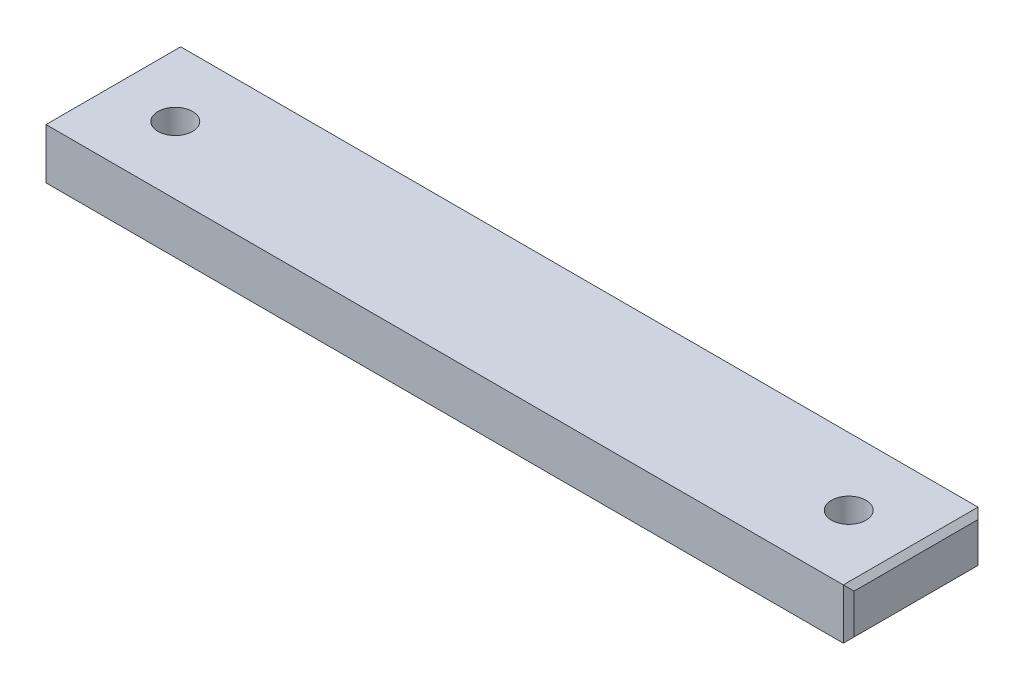
ISO-10303-21;
HEADER;
FILE_DESCRIPTION(('STEP AP214'),'2;1');
FILE_NAME('part.step','',(''),(''),'','','');
FILE_SCHEMA(('AUTOMOTIVE_DESIGN { 1 0 10303 214 1 1 1 1 }'));
ENDSEC;
DATA;
#1=APPLICATION_CONTEXT('core data for automotive mechanical design processes');
#2=APPLICATION_PROTOCOL_DEFINITION('international standard','automotive_design',2000,#1);
#3=PRODUCT_CONTEXT('',#1,'mechanical');
#4=PRODUCT('Part','Part','',(#3));
#5=PRODUCT_RELATED_PRODUCT_CATEGORY('part','',(#4));
#6=PRODUCT_DEFINITION_FORMATION('','',#4);
#7=PRODUCT_DEFINITION_CONTEXT('part definition',#1,'design');
#8=PRODUCT_DEFINITION('design','',#6,#7);
#9=PRODUCT_DEFINITION_SHAPE('','',#8);
#10=(LENGTH_UNIT() NAMED_UNIT(*) SI_UNIT(.MILLI.,.METRE.));
#11=(NAMED_UNIT(*) PLANE_ANGLE_UNIT() SI_UNIT($,.RADIAN.));
#12=(NAMED_UNIT(*) SI_UNIT($,.STERADIAN.) SOLID_ANGLE_UNIT());
#13=UNCERTAINTY_MEASURE_WITH_UNIT(LENGTH_MEASURE(1.E-05),#10,'distance_accuracy_value','');
#14=(GEOMETRIC_REPRESENTATION_CONTEXT(3) GLOBAL_UNCERTAINTY_ASSIGNED_CONTEXT((#13)) GLOBAL_UNIT_ASSIGNED_CONTEXT((#10,
#11,#12)) REPRESENTATION_CONTEXT('',''));
#15=CARTESIAN_POINT('',(0.,0.,0.));
#16=DIRECTION('',(0.,0.,1.));
#17=DIRECTION('',(1.,0.,0.));
#18=AXIS2_PLACEMENT_3D('',#15,#16,#17);
#19=CARTESIAN_POINT('',(0.,4.7625,6.35));
#20=DIRECTION('',(0.,0.,-1.));
#21=DIRECTION('',(-1.,0.,0.));
#22=AXIS2_PLACEMENT_3D('',#19,#20,#21);
#23=PLANE('',#22);
#24=DIRECTION('',(1.,0.,0.));
#25=VECTOR('',#24,1.);
#26=CARTESIAN_POINT('',(0.,4.7625,6.35));
#27=LINE('',#26,#25);
#28=CARTESIAN_POINT('',(-69.342,4.7625,6.35));
#29=VERTEX_POINT('',#28);
#30=CARTESIAN_POINT('',(5.84199999999999,4.7625,6.35));
#31=VERTEX_POINT('',#30);
#32=EDGE_CURVE('E182',#29,#31,#27,.T.);
#33=ORIENTED_EDGE('',*,*,#32,.F.);
#34=DIRECTION('',(0.,-1.,0.));
#35=VECTOR('',#34,1.);
#36=CARTESIAN_POINT('',(-69.342,0.,6.35));
#37=LINE('',#36,#35);
#38=CARTESIAN_POINT('',(-69.342,0.,6.35));
#39=VERTEX_POINT('',#38);
#40=EDGE_CURVE('E140',#29,#39,#37,.T.);
#41=ORIENTED_EDGE('',*,*,#40,.T.);
#42=DIRECTION('',(1.,0.,0.));
#43=VECTOR('',#42,1.);
#44=CARTESIAN_POINT('',(0.,0.,6.35));
#45=LINE('',#44,#43);
#46=CARTESIAN_POINT('',(5.84199999999999,0.,6.35));
#47=VERTEX_POINT('',#46);
#48=EDGE_CURVE('E183',#39,#47,#45,.T.);
#49=ORIENTED_EDGE('',*,*,#48,.T.);
#50=DIRECTION('',(0.,1.,0.));
#51=VECTOR('',#50,1.);
#52=CARTESIAN_POINT('',(5.84199999999999,4.7625,6.35));
#53=LINE('',#52,#51);
#54=EDGE_CURVE('E137',#47,#31,#53,.T.);
#55=ORIENTED_EDGE('',*,*,#54,.T.);
#56=EDGE_LOOP('',(#33,#41,#49,#55));
#57=FACE_BOUND('',#56,.T.);
#58=ADVANCED_FACE('F35',(#57),#23,.F.);
#59=CARTESIAN_POINT('',(6.35,4.7625,0.));
#60=DIRECTION('',(-1.,0.,0.));
#61=DIRECTION('',(0.,0.,1.));
#62=AXIS2_PLACEMENT_3D('',#59,#60,#61);
#63=PLANE('',#62);
#64=DIRECTION('',(0.,0.,1.));
#65=VECTOR('',#64,1.);
#66=CARTESIAN_POINT('',(6.35,4.2545,6.35));
#67=LINE('',#66,#65);
#68=CARTESIAN_POINT('',(6.35,4.2545,-5.842));
#69=VERTEX_POINT('',#68);
#70=CARTESIAN_POINT('',(6.35,4.2545,5.842));
#71=VERTEX_POINT('',#70);
#72=EDGE_CURVE('E44',#69,#71,#67,.T.);
#73=ORIENTED_EDGE('',*,*,#72,.T.);
#74=DIRECTION('',(0.,-1.,0.));
#75=VECTOR('',#74,1.);
#76=CARTESIAN_POINT('',(6.35,4.7625,5.842));
#77=LINE('',#76,#75);
#78=CARTESIAN_POINT('',(6.35,0.508000000000002,5.842));
#79=VERTEX_POINT('',#78);
#80=EDGE_CURVE('E11',#71,#79,#77,.T.);
#81=ORIENTED_EDGE('',*,*,#80,.T.);
#82=DIRECTION('',(0.,0.,-1.));
#83=VECTOR('',#82,1.);
#84=CARTESIAN_POINT('',(6.35,0.508000000000002,0.));
#85=LINE('',#84,#83);
#86=CARTESIAN_POINT('',(6.35,0.508000000000002,-5.842));
#87=VERTEX_POINT('',#86);
#88=EDGE_CURVE('E146',#79,#87,#85,.T.);
#89=ORIENTED_EDGE('',*,*,#88,.T.);
#90=DIRECTION('',(0.,1.,0.));
#91=VECTOR('',#90,1.);
#92=CARTESIAN_POINT('',(6.35,4.7625,-5.842));
#93=LINE('',#92,#91);
#94=EDGE_CURVE('E55',#87,#69,#93,.T.);
#95=ORIENTED_EDGE('',*,*,#94,.T.);
#96=EDGE_LOOP('',(#73,#81,#89,#95));
#97=FACE_BOUND('',#96,.T.);
#98=ADVANCED_FACE('F237',(#97),#63,.F.);
#99=CARTESIAN_POINT('',(0.,4.7625,-6.35));
#100=DIRECTION('',(0.,0.,-1.));
#101=DIRECTION('',(-1.,0.,0.));
#102=AXIS2_PLACEMENT_3D('',#99,#100,#101);
#103=PLANE('',#102);
#104=DIRECTION('',(1.,0.,0.));
#105=VECTOR('',#104,1.);
#106=CARTESIAN_POINT('',(0.,0.,-6.35));
#107=LINE('',#106,#105);
#108=CARTESIAN_POINT('',(-69.342,0.,-6.35));
#109=VERTEX_POINT('',#108);
#110=CARTESIAN_POINT('',(5.84199999999999,0.,-6.35));
#111=VERTEX_POINT('',#110);
#112=EDGE_CURVE('E176',#109,#111,#107,.T.);
#113=ORIENTED_EDGE('',*,*,#112,.F.);
#114=DIRECTION('',(0.,1.,0.));
#115=VECTOR('',#114,1.);
#116=CARTESIAN_POINT('',(-69.342,4.7625,-6.35));
#117=LINE('',#116,#115);
#118=CARTESIAN_POINT('',(-69.342,4.7625,-6.35));
#119=VERTEX_POINT('',#118);
#120=EDGE_CURVE('E107',#109,#119,#117,.T.);
#121=ORIENTED_EDGE('',*,*,#120,.T.);
#122=DIRECTION('',(1.,0.,0.));
#123=VECTOR('',#122,1.);
#124=CARTESIAN_POINT('',(0.,4.7625,-6.35));
#125=LINE('',#124,#123);
#126=CARTESIAN_POINT('',(5.84199999999999,4.7625,-6.35));
#127=VERTEX_POINT('',#126);
#128=EDGE_CURVE('E120',#119,#127,#125,.T.);
#129=ORIENTED_EDGE('',*,*,#128,.T.);
#130=DIRECTION('',(0.,-1.,0.));
#131=VECTOR('',#130,1.);
#132=CARTESIAN_POINT('',(5.84199999999999,0.,-6.35));
#133=LINE('',#132,#131);
#134=EDGE_CURVE('E126',#127,#111,#133,.T.);
#135=ORIENTED_EDGE('',*,*,#134,.T.);
#136=EDGE_LOOP('',(#113,#121,#129,#135));
#137=FACE_BOUND('',#136,.T.);
#138=ADVANCED_FACE('F175',(#137),#103,.T.);
#139=CARTESIAN_POINT('',(-69.85,4.7625,0.));
#140=DIRECTION('',(-1.,0.,0.));
#141=DIRECTION('',(0.,0.,1.));
#142=AXIS2_PLACEMENT_3D('',#139,#140,#141);
#143=PLANE('',#142);
#144=DIRECTION('',(0.,0.,-1.));
#145=VECTOR('',#144,1.);
#146=CARTESIAN_POINT('',(-69.85,4.2545,0.));
#147=LINE('',#146,#145);
#148=CARTESIAN_POINT('',(-69.85,4.2545,5.842));
#149=VERTEX_POINT('',#148);
#150=CARTESIAN_POINT('',(-69.85,4.2545,-5.842));
#151=VERTEX_POINT('',#150);
#152=EDGE_CURVE('E124',#149,#151,#147,.T.);
#153=ORIENTED_EDGE('',*,*,#152,.T.);
#154=DIRECTION('',(0.,-1.,0.));
#155=VECTOR('',#154,1.);
#156=CARTESIAN_POINT('',(-69.85,4.7625,-5.842));
#157=LINE('',#156,#155);
#158=CARTESIAN_POINT('',(-69.85,0.508000000000002,-5.842));
#159=VERTEX_POINT('',#158);
#160=EDGE_CURVE('E105',#151,#159,#157,.T.);
#161=ORIENTED_EDGE('',*,*,#160,.T.);
#162=DIRECTION('',(0.,0.,1.));
#163=VECTOR('',#162,1.);
#164=CARTESIAN_POINT('',(-69.85,0.508000000000002,6.35000000000001));
#165=LINE('',#164,#163);
#166=CARTESIAN_POINT('',(-69.85,0.508000000000002,5.842));
#167=VERTEX_POINT('',#166);
#168=EDGE_CURVE('E113',#159,#167,#165,.T.);
#169=ORIENTED_EDGE('',*,*,#168,.T.);
#170=DIRECTION('',(0.,1.,0.));
#171=VECTOR('',#170,1.);
#172=CARTESIAN_POINT('',(-69.85,4.7625,5.842));
#173=LINE('',#172,#171);
#174=EDGE_CURVE('E119',#167,#149,#173,.T.);
#175=ORIENTED_EDGE('',*,*,#174,.T.);
#176=EDGE_LOOP('',(#153,#161,#169,#175));
#177=FACE_BOUND('',#176,.T.);
#178=ADVANCED_FACE('F122',(#177),#143,.T.);
#179=CARTESIAN_POINT('',(0.,4.7625,0.));
#180=DIRECTION('',(0.,1.,0.));
#181=DIRECTION('',(0.,0.,1.));
#182=AXIS2_PLACEMENT_3D('',#179,#180,#181);
#183=PLANE('',#182);
#184=CARTESIAN_POINT('',(0.,4.7625,0.));
#185=DIRECTION('',(0.,-1.,0.));
#186=DIRECTION('',(0.,0.,-1.));
#187=AXIS2_PLACEMENT_3D('',#184,#185,#186);
#188=CIRCLE('',#187,1.63195);
#189=CARTESIAN_POINT('',(0.,4.7625,-1.63195));
#190=VERTEX_POINT('',#189);
#191=EDGE_CURVE('E206',#190,#190,#188,.T.);
#192=ORIENTED_EDGE('',*,*,#191,.T.);
#193=EDGE_LOOP('',(#192));
#194=FACE_BOUND('',#193,.T.);
#195=CARTESIAN_POINT('',(-63.5,4.7625,0.));
#196=DIRECTION('',(0.,1.,0.));
#197=DIRECTION('',(0.,0.,1.));
#198=AXIS2_PLACEMENT_3D('',#195,#196,#197);
#199=CIRCLE('',#198,1.63195);
#200=CARTESIAN_POINT('',(-63.5,4.7625,1.63195));
#201=VERTEX_POINT('',#200);
#202=EDGE_CURVE('E203',#201,#201,#199,.T.);
#203=ORIENTED_EDGE('',*,*,#202,.F.);
#204=EDGE_LOOP('',(#203));
#205=FACE_BOUND('',#204,.T.);
#206=ORIENTED_EDGE('',*,*,#128,.F.);
#207=DIRECTION('',(0.,0.,1.));
#208=VECTOR('',#207,1.);
#209=CARTESIAN_POINT('',(-69.342,4.7625,0.));
#210=LINE('',#209,#208);
#211=EDGE_CURVE('E135',#119,#29,#210,.T.);
#212=ORIENTED_EDGE('',*,*,#211,.T.);
#213=ORIENTED_EDGE('',*,*,#32,.T.);
#214=DIRECTION('',(0.,0.,-1.));
#215=VECTOR('',#214,1.);
#216=CARTESIAN_POINT('',(5.84199999999999,4.7625,-6.35));
#217=LINE('',#216,#215);
#218=EDGE_CURVE('E133',#31,#127,#217,.T.);
#219=ORIENTED_EDGE('',*,*,#218,.T.);
#220=EDGE_LOOP('',(#206,#212,#213,#219));
#221=FACE_BOUND('',#220,.T.);
#222=ADVANCED_FACE('F199',(#194,#205,#221),#183,.T.);
#223=CARTESIAN_POINT('',(0.,0.,0.));
#224=DIRECTION('',(0.,1.,0.));
#225=DIRECTION('',(0.,0.,1.));
#226=AXIS2_PLACEMENT_3D('',#223,#224,#225);
#227=PLANE('',#226);
#228=CARTESIAN_POINT('',(0.,0.,0.));
#229=DIRECTION('',(0.,-1.,0.));
#230=DIRECTION('',(0.,0.,-1.));
#231=AXIS2_PLACEMENT_3D('',#228,#229,#230);
#232=CIRCLE('',#231,3.2385);
#233=CARTESIAN_POINT('',(0.,0.,-3.2385));
#234=VERTEX_POINT('',#233);
#235=EDGE_CURVE('E155',#234,#234,#232,.T.);
#236=ORIENTED_EDGE('',*,*,#235,.F.);
#237=EDGE_LOOP('',(#236));
#238=FACE_BOUND('',#237,.T.);
#239=CARTESIAN_POINT('',(-63.5,0.,0.));
#240=DIRECTION('',(0.,1.,0.));
#241=DIRECTION('',(0.,0.,1.));
#242=AXIS2_PLACEMENT_3D('',#239,#240,#241);
#243=CIRCLE('',#242,1.63195);
#244=CARTESIAN_POINT('',(-63.5,0.,1.63195));
#245=VERTEX_POINT('',#244);
#246=EDGE_CURVE('E187',#245,#245,#243,.T.);
#247=ORIENTED_EDGE('',*,*,#246,.T.);
#248=EDGE_LOOP('',(#247));
#249=FACE_BOUND('',#248,.T.);
#250=ORIENTED_EDGE('',*,*,#48,.F.);
#251=DIRECTION('',(0.,0.,-1.));
#252=VECTOR('',#251,1.);
#253=CARTESIAN_POINT('',(-69.342,0.,-6.34999999999999));
#254=LINE('',#253,#252);
#255=EDGE_CURVE('E144',#39,#109,#254,.T.);
#256=ORIENTED_EDGE('',*,*,#255,.T.);
#257=ORIENTED_EDGE('',*,*,#112,.T.);
#258=DIRECTION('',(0.,0.,1.));
#259=VECTOR('',#258,1.);
#260=CARTESIAN_POINT('',(5.84199999999999,0.,0.));
#261=LINE('',#260,#259);
#262=EDGE_CURVE('E142',#111,#47,#261,.T.);
#263=ORIENTED_EDGE('',*,*,#262,.T.);
#264=EDGE_LOOP('',(#250,#256,#257,#263));
#265=FACE_BOUND('',#264,.T.);
#266=ADVANCED_FACE('F180',(#238,#249,#265),#227,.F.);
#267=CARTESIAN_POINT('',(-63.5,4.7625,0.));
#268=DIRECTION('',(0.,1.,0.));
#269=DIRECTION('',(0.,0.,1.));
#270=AXIS2_PLACEMENT_3D('',#267,#268,#269);
#271=CYLINDRICAL_SURFACE('',#270,1.63195);
#272=ORIENTED_EDGE('',*,*,#246,.F.);
#273=EDGE_LOOP('',(#272));
#274=FACE_BOUND('',#273,.T.);
#275=ORIENTED_EDGE('',*,*,#202,.T.);
#276=EDGE_LOOP('',(#275));
#277=FACE_BOUND('',#276,.T.);
#278=ADVANCED_FACE('F219',(#274,#277),#271,.F.);
#279=CARTESIAN_POINT('',(0.,0.,0.));
#280=DIRECTION('',(0.,-1.,0.));
#281=DIRECTION('',(0.,0.,-1.));
#282=AXIS2_PLACEMENT_3D('',#279,#280,#281);
#283=CYLINDRICAL_SURFACE('',#282,1.63194999999999);
#284=ORIENTED_EDGE('',*,*,#191,.F.);
#285=EDGE_LOOP('',(#284));
#286=FACE_BOUND('',#285,.T.);
#287=CARTESIAN_POINT('',(0.,1.84812436462092,0.));
#288=DIRECTION('',(0.,-1.,0.));
#289=DIRECTION('',(0.,0.,-1.));
#290=AXIS2_PLACEMENT_3D('',#287,#288,#289);
#291=CIRCLE('',#290,1.63194999999999);
#292=CARTESIAN_POINT('',(0.,1.84812436462092,-1.63194999999999));
#293=VERTEX_POINT('',#292);
#294=EDGE_CURVE('E209',#293,#293,#291,.T.);
#295=ORIENTED_EDGE('',*,*,#294,.T.);
#296=EDGE_LOOP('',(#295));
#297=FACE_BOUND('',#296,.T.);
#298=ADVANCED_FACE('F225',(#286,#297),#283,.F.);
#299=CARTESIAN_POINT('',(0.,0.,0.));
#300=DIRECTION('',(0.,-1.,0.));
#301=DIRECTION('',(0.,0.,-1.));
#302=AXIS2_PLACEMENT_3D('',#299,#300,#301);
#303=CONICAL_SURFACE('',#302,3.2385,0.715584993317676);
#304=ORIENTED_EDGE('',*,*,#294,.F.);
#305=EDGE_LOOP('',(#304));
#306=FACE_BOUND('',#305,.T.);
#307=ORIENTED_EDGE('',*,*,#235,.T.);
#308=EDGE_LOOP('',(#307));
#309=FACE_BOUND('',#308,.T.);
#310=ADVANCED_FACE('F215',(#306,#309),#303,.F.);
#311=CARTESIAN_POINT('',(-69.342,4.7625,6.35));
#312=DIRECTION('',(-0.707106781186534,0.,0.707106781186561));
#313=DIRECTION('',(0.,1.,0.));
#314=AXIS2_PLACEMENT_3D('',#311,#312,#313);
#315=PLANE('',#314);
#316=DIRECTION('',(-0.577350269189636,0.577350269189628,-0.577350269189613));
#317=VECTOR('',#316,1.);
#318=CARTESIAN_POINT('',(-71.4586666666667,2.11666666666662,4.23333333333342));
#319=LINE('',#318,#317);
#320=EDGE_CURVE('E116',#39,#167,#319,.T.);
#321=ORIENTED_EDGE('',*,*,#320,.F.);
#322=ORIENTED_EDGE('',*,*,#40,.F.);
#323=DIRECTION('',(0.577350269189636,0.577350269189628,0.577350269189613));
#324=VECTOR('',#323,1.);
#325=CARTESIAN_POINT('',(-69.342,4.76250000000001,6.35));
#326=LINE('',#325,#324);
#327=EDGE_CURVE('E152',#149,#29,#326,.T.);
#328=ORIENTED_EDGE('',*,*,#327,.F.);
#329=ORIENTED_EDGE('',*,*,#174,.F.);
#330=EDGE_LOOP('',(#321,#322,#328,#329));
#331=FACE_BOUND('',#330,.T.);
#332=ADVANCED_FACE('F193',(#331),#315,.T.);
#333=CARTESIAN_POINT('',(-69.85,4.2545,0.));
#334=DIRECTION('',(0.707106781186543,-0.707106781186552,0.));
#335=DIRECTION('',(0.,0.,-1.));
#336=AXIS2_PLACEMENT_3D('',#333,#334,#335);
#337=PLANE('',#336);
#338=ORIENTED_EDGE('',*,*,#327,.T.);
#339=ORIENTED_EDGE('',*,*,#211,.F.);
#340=DIRECTION('',(-0.577350269189636,-0.577350269189628,0.577350269189613));
#341=VECTOR('',#340,1.);
#342=CARTESIAN_POINT('',(-71.7973333333333,2.3071666666667,-3.89466666666675));
#343=LINE('',#342,#341);
#344=EDGE_CURVE('E110',#151,#119,#343,.F.);
#345=ORIENTED_EDGE('',*,*,#344,.F.);
#346=ORIENTED_EDGE('',*,*,#152,.F.);
#347=EDGE_LOOP('',(#338,#339,#345,#346));
#348=FACE_BOUND('',#347,.T.);
#349=ADVANCED_FACE('F196',(#348),#337,.F.);
#350=CARTESIAN_POINT('',(-69.342,0.,0.));
#351=DIRECTION('',(-0.707106781186543,-0.707106781186552,0.));
#352=DIRECTION('',(0.,0.,1.));
#353=AXIS2_PLACEMENT_3D('',#350,#351,#352);
#354=PLANE('',#353);
#355=ORIENTED_EDGE('',*,*,#320,.T.);
#356=ORIENTED_EDGE('',*,*,#168,.F.);
#357=DIRECTION('',(-0.577350269189636,0.577350269189628,0.577350269189613));
#358=VECTOR('',#357,1.);
#359=CARTESIAN_POINT('',(-71.4586666666667,2.11666666666662,-4.23333333333342));
#360=LINE('',#359,#358);
#361=EDGE_CURVE('E101',#109,#159,#360,.T.);
#362=ORIENTED_EDGE('',*,*,#361,.F.);
#363=ORIENTED_EDGE('',*,*,#255,.F.);
#364=EDGE_LOOP('',(#355,#356,#362,#363));
#365=FACE_BOUND('',#364,.T.);
#366=ADVANCED_FACE('F114',(#365),#354,.T.);
#367=CARTESIAN_POINT('',(-69.85,4.7625,-5.842));
#368=DIRECTION('',(0.707106781186534,0.,0.707106781186561));
#369=DIRECTION('',(0.,-1.,0.));
#370=AXIS2_PLACEMENT_3D('',#367,#368,#369);
#371=PLANE('',#370);
#372=ORIENTED_EDGE('',*,*,#344,.T.);
#373=ORIENTED_EDGE('',*,*,#120,.F.);
#374=ORIENTED_EDGE('',*,*,#361,.T.);
#375=ORIENTED_EDGE('',*,*,#160,.F.);
#376=EDGE_LOOP('',(#372,#373,#374,#375));
#377=FACE_BOUND('',#376,.T.);
#378=ADVANCED_FACE('F103',(#377),#371,.F.);
#379=CARTESIAN_POINT('',(5.84199999999999,4.7625,-6.35));
#380=DIRECTION('',(0.707106781186543,0.,-0.707106781186552));
#381=DIRECTION('',(0.,1.,0.));
#382=AXIS2_PLACEMENT_3D('',#379,#380,#381);
#383=PLANE('',#382);
#384=DIRECTION('',(-0.577350269189631,-0.577350269189623,-0.577350269189623));
#385=VECTOR('',#384,1.);
#386=CARTESIAN_POINT('',(8.29733333333334,2.45533333333332,-3.89466666666668));
#387=LINE('',#386,#385);
#388=EDGE_CURVE('E159',#111,#87,#387,.F.);
#389=ORIENTED_EDGE('',*,*,#388,.F.);
#390=ORIENTED_EDGE('',*,*,#134,.F.);
#391=DIRECTION('',(0.577350269189631,-0.577350269189623,0.577350269189623));
#392=VECTOR('',#391,1.);
#393=CARTESIAN_POINT('',(5.84199999999999,4.7625,-6.35));
#394=LINE('',#393,#392);
#395=EDGE_CURVE('E39',#69,#127,#394,.F.);
#396=ORIENTED_EDGE('',*,*,#395,.F.);
#397=ORIENTED_EDGE('',*,*,#94,.F.);
#398=EDGE_LOOP('',(#389,#390,#396,#397));
#399=FACE_BOUND('',#398,.T.);
#400=ADVANCED_FACE('F37',(#399),#383,.T.);
#401=CARTESIAN_POINT('',(5.84199999999999,4.7625,0.));
#402=DIRECTION('',(0.707106781186543,0.707106781186552,0.));
#403=DIRECTION('',(0.,0.,1.));
#404=AXIS2_PLACEMENT_3D('',#401,#402,#403);
#405=PLANE('',#404);
#406=ORIENTED_EDGE('',*,*,#395,.T.);
#407=ORIENTED_EDGE('',*,*,#218,.F.);
#408=DIRECTION('',(-0.577350269189631,0.577350269189623,0.577350269189623));
#409=VECTOR('',#408,1.);
#410=CARTESIAN_POINT('',(7.95866666666667,2.64583333333335,4.23333333333335));
#411=LINE('',#410,#409);
#412=EDGE_CURVE('E158',#71,#31,#411,.T.);
#413=ORIENTED_EDGE('',*,*,#412,.F.);
#414=ORIENTED_EDGE('',*,*,#72,.F.);
#415=EDGE_LOOP('',(#406,#407,#413,#414));
#416=FACE_BOUND('',#415,.T.);
#417=ADVANCED_FACE('F168',(#416),#405,.T.);
#418=CARTESIAN_POINT('',(6.35,0.508000000000002,0.));
#419=DIRECTION('',(-0.707106781186543,0.707106781186552,0.));
#420=DIRECTION('',(0.,0.,-1.));
#421=AXIS2_PLACEMENT_3D('',#418,#419,#420);
#422=PLANE('',#421);
#423=ORIENTED_EDGE('',*,*,#388,.T.);
#424=ORIENTED_EDGE('',*,*,#88,.F.);
#425=DIRECTION('',(-0.577350269189631,-0.577350269189623,0.577350269189623));
#426=VECTOR('',#425,1.);
#427=CARTESIAN_POINT('',(8.29733333333334,2.45533333333332,3.89466666666668));
#428=LINE('',#427,#426);
#429=EDGE_CURVE('E156',#47,#79,#428,.F.);
#430=ORIENTED_EDGE('',*,*,#429,.F.);
#431=ORIENTED_EDGE('',*,*,#262,.F.);
#432=EDGE_LOOP('',(#423,#424,#430,#431));
#433=FACE_BOUND('',#432,.T.);
#434=ADVANCED_FACE('F257',(#433),#422,.F.);
#435=CARTESIAN_POINT('',(6.35,4.7625,5.842));
#436=DIRECTION('',(-0.707106781186543,0.,-0.707106781186552));
#437=DIRECTION('',(0.,-1.,0.));
#438=AXIS2_PLACEMENT_3D('',#435,#436,#437);
#439=PLANE('',#438);
#440=ORIENTED_EDGE('',*,*,#412,.T.);
#441=ORIENTED_EDGE('',*,*,#54,.F.);
#442=ORIENTED_EDGE('',*,*,#429,.T.);
#443=ORIENTED_EDGE('',*,*,#80,.F.);
#444=EDGE_LOOP('',(#440,#441,#442,#443));
#445=FACE_BOUND('',#444,.T.);
#446=ADVANCED_FACE('F254',(#445),#439,.F.);
#447=CLOSED_SHELL('',(#58,#98,#138,#178,#222,#266,#278,#298,#310,#332,#349,#366,#378,#400,#417,
#434,#446));
#448=MANIFOLD_SOLID_BREP('B2',#447);
#449=ADVANCED_BREP_SHAPE_REPRESENTATION('',(#18,#448),#14);
#450=SHAPE_DEFINITION_REPRESENTATION(#9,#449);
ENDSEC;
END-ISO-10303-21;
